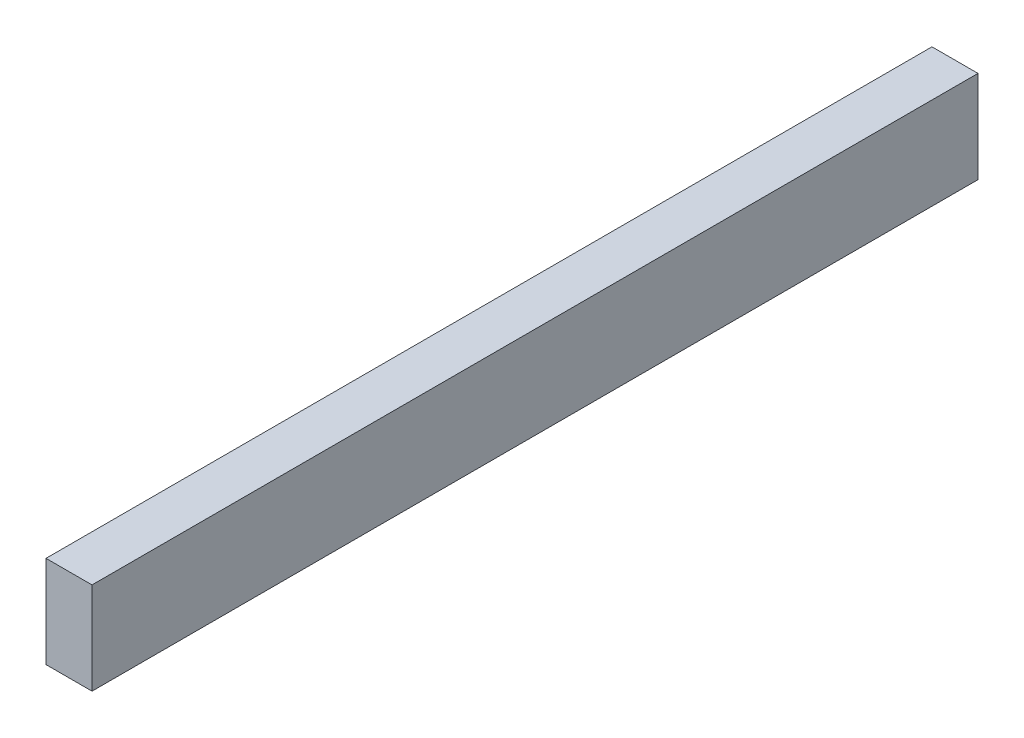
ISO-10303-21;
HEADER;
FILE_DESCRIPTION(('STEP AP214'),'2;1');
FILE_NAME('part.step','',(''),(''),'','','');
FILE_SCHEMA(('AUTOMOTIVE_DESIGN { 1 0 10303 214 1 1 1 1 }'));
ENDSEC;
DATA;
#1=APPLICATION_CONTEXT('core data for automotive mechanical design processes');
#2=APPLICATION_PROTOCOL_DEFINITION('international standard','automotive_design',2000,#1);
#3=PRODUCT_CONTEXT('',#1,'mechanical');
#4=PRODUCT('Part','Part','',(#3));
#5=PRODUCT_RELATED_PRODUCT_CATEGORY('part','',(#4));
#6=PRODUCT_DEFINITION_FORMATION('','',#4);
#7=PRODUCT_DEFINITION_CONTEXT('part definition',#1,'design');
#8=PRODUCT_DEFINITION('design','',#6,#7);
#9=PRODUCT_DEFINITION_SHAPE('','',#8);
#10=(LENGTH_UNIT() NAMED_UNIT(*) SI_UNIT(.MILLI.,.METRE.));
#11=(NAMED_UNIT(*) PLANE_ANGLE_UNIT() SI_UNIT($,.RADIAN.));
#12=(NAMED_UNIT(*) SI_UNIT($,.STERADIAN.) SOLID_ANGLE_UNIT());
#13=UNCERTAINTY_MEASURE_WITH_UNIT(LENGTH_MEASURE(1.E-05),#10,'distance_accuracy_value','');
#14=(GEOMETRIC_REPRESENTATION_CONTEXT(3) GLOBAL_UNCERTAINTY_ASSIGNED_CONTEXT((#13)) GLOBAL_UNIT_ASSIGNED_CONTEXT((#10,
#11,#12)) REPRESENTATION_CONTEXT('',''));
#15=CARTESIAN_POINT('',(0.,0.,0.));
#16=DIRECTION('',(0.,0.,1.));
#17=DIRECTION('',(1.,0.,0.));
#18=AXIS2_PLACEMENT_3D('',#15,#16,#17);
#19=CARTESIAN_POINT('',(0.,0.,366.7125));
#20=DIRECTION('',(1.,0.,0.));
#21=DIRECTION('',(0.,0.,-1.));
#22=AXIS2_PLACEMENT_3D('',#19,#20,#21);
#23=PLANE('',#22);
#24=DIRECTION('',(0.,-1.,0.));
#25=VECTOR('',#24,1.);
#26=CARTESIAN_POINT('',(0.,0.,0.));
#27=LINE('',#26,#25);
#28=CARTESIAN_POINT('',(0.,38.1,0.));
#29=VERTEX_POINT('',#28);
#30=CARTESIAN_POINT('',(0.,0.,0.));
#31=VERTEX_POINT('',#30);
#32=EDGE_CURVE('E96',#29,#31,#27,.T.);
#33=ORIENTED_EDGE('',*,*,#32,.T.);
#34=DIRECTION('',(0.,0.,-1.));
#35=VECTOR('',#34,1.);
#36=CARTESIAN_POINT('',(0.,0.,366.7125));
#37=LINE('',#36,#35);
#38=CARTESIAN_POINT('',(0.,0.,366.7125));
#39=VERTEX_POINT('',#38);
#40=EDGE_CURVE('E11',#39,#31,#37,.T.);
#41=ORIENTED_EDGE('',*,*,#40,.F.);
#42=DIRECTION('',(0.,-1.,0.));
#43=VECTOR('',#42,1.);
#44=CARTESIAN_POINT('',(0.,0.,366.7125));
#45=LINE('',#44,#43);
#46=CARTESIAN_POINT('',(0.,38.1,366.7125));
#47=VERTEX_POINT('',#46);
#48=EDGE_CURVE('E84',#47,#39,#45,.T.);
#49=ORIENTED_EDGE('',*,*,#48,.F.);
#50=DIRECTION('',(0.,0.,-1.));
#51=VECTOR('',#50,1.);
#52=CARTESIAN_POINT('',(0.,38.1,366.7125));
#53=LINE('',#52,#51);
#54=EDGE_CURVE('E92',#47,#29,#53,.T.);
#55=ORIENTED_EDGE('',*,*,#54,.T.);
#56=EDGE_LOOP('',(#33,#41,#49,#55));
#57=FACE_BOUND('',#56,.T.);
#58=ADVANCED_FACE('F33',(#57),#23,.F.);
#59=CARTESIAN_POINT('',(0.,0.,366.7125));
#60=DIRECTION('',(0.,1.,0.));
#61=DIRECTION('',(0.,0.,1.));
#62=AXIS2_PLACEMENT_3D('',#59,#60,#61);
#63=PLANE('',#62);
#64=DIRECTION('',(1.,0.,0.));
#65=VECTOR('',#64,1.);
#66=CARTESIAN_POINT('',(0.,0.,0.));
#67=LINE('',#66,#65);
#68=CARTESIAN_POINT('',(19.05,0.,0.));
#69=VERTEX_POINT('',#68);
#70=EDGE_CURVE('E88',#31,#69,#67,.T.);
#71=ORIENTED_EDGE('',*,*,#70,.T.);
#72=DIRECTION('',(0.,0.,-1.));
#73=VECTOR('',#72,1.);
#74=CARTESIAN_POINT('',(19.05,0.,366.7125));
#75=LINE('',#74,#73);
#76=CARTESIAN_POINT('',(19.05,0.,366.7125));
#77=VERTEX_POINT('',#76);
#78=EDGE_CURVE('E41',#77,#69,#75,.T.);
#79=ORIENTED_EDGE('',*,*,#78,.F.);
#80=DIRECTION('',(1.,0.,0.));
#81=VECTOR('',#80,1.);
#82=CARTESIAN_POINT('',(0.,0.,366.7125));
#83=LINE('',#82,#81);
#84=EDGE_CURVE('E79',#39,#77,#83,.T.);
#85=ORIENTED_EDGE('',*,*,#84,.F.);
#86=ORIENTED_EDGE('',*,*,#40,.T.);
#87=EDGE_LOOP('',(#71,#79,#85,#86));
#88=FACE_BOUND('',#87,.T.);
#89=ADVANCED_FACE('F87',(#88),#63,.F.);
#90=CARTESIAN_POINT('',(19.05,0.,366.7125));
#91=DIRECTION('',(-1.,0.,0.));
#92=DIRECTION('',(0.,0.,1.));
#93=AXIS2_PLACEMENT_3D('',#90,#91,#92);
#94=PLANE('',#93);
#95=DIRECTION('',(0.,1.,0.));
#96=VECTOR('',#95,1.);
#97=CARTESIAN_POINT('',(19.05,0.,0.));
#98=LINE('',#97,#96);
#99=CARTESIAN_POINT('',(19.05,38.1,0.));
#100=VERTEX_POINT('',#99);
#101=EDGE_CURVE('E66',#69,#100,#98,.T.);
#102=ORIENTED_EDGE('',*,*,#101,.T.);
#103=DIRECTION('',(0.,0.,-1.));
#104=VECTOR('',#103,1.);
#105=CARTESIAN_POINT('',(19.05,38.1,366.7125));
#106=LINE('',#105,#104);
#107=CARTESIAN_POINT('',(19.05,38.1,366.7125));
#108=VERTEX_POINT('',#107);
#109=EDGE_CURVE('E89',#108,#100,#106,.T.);
#110=ORIENTED_EDGE('',*,*,#109,.F.);
#111=DIRECTION('',(0.,1.,0.));
#112=VECTOR('',#111,1.);
#113=CARTESIAN_POINT('',(19.05,0.,366.7125));
#114=LINE('',#113,#112);
#115=EDGE_CURVE('E82',#77,#108,#114,.T.);
#116=ORIENTED_EDGE('',*,*,#115,.F.);
#117=ORIENTED_EDGE('',*,*,#78,.T.);
#118=EDGE_LOOP('',(#102,#110,#116,#117));
#119=FACE_BOUND('',#118,.T.);
#120=ADVANCED_FACE('F90',(#119),#94,.F.);
#121=CARTESIAN_POINT('',(0.,38.1,366.7125));
#122=DIRECTION('',(0.,-1.,0.));
#123=DIRECTION('',(0.,0.,-1.));
#124=AXIS2_PLACEMENT_3D('',#121,#122,#123);
#125=PLANE('',#124);
#126=DIRECTION('',(-1.,0.,0.));
#127=VECTOR('',#126,1.);
#128=CARTESIAN_POINT('',(0.,38.1,0.));
#129=LINE('',#128,#127);
#130=EDGE_CURVE('E72',#100,#29,#129,.T.);
#131=ORIENTED_EDGE('',*,*,#130,.T.);
#132=ORIENTED_EDGE('',*,*,#54,.F.);
#133=DIRECTION('',(-1.,0.,0.));
#134=VECTOR('',#133,1.);
#135=CARTESIAN_POINT('',(0.,38.1,366.7125));
#136=LINE('',#135,#134);
#137=EDGE_CURVE('E49',#108,#47,#136,.T.);
#138=ORIENTED_EDGE('',*,*,#137,.F.);
#139=ORIENTED_EDGE('',*,*,#109,.T.);
#140=EDGE_LOOP('',(#131,#132,#138,#139));
#141=FACE_BOUND('',#140,.T.);
#142=ADVANCED_FACE('F103',(#141),#125,.F.);
#143=CARTESIAN_POINT('',(0.,0.,366.7125));
#144=DIRECTION('',(0.,0.,-1.));
#145=DIRECTION('',(-1.,0.,0.));
#146=AXIS2_PLACEMENT_3D('',#143,#144,#145);
#147=PLANE('',#146);
#148=ORIENTED_EDGE('',*,*,#48,.T.);
#149=ORIENTED_EDGE('',*,*,#84,.T.);
#150=ORIENTED_EDGE('',*,*,#115,.T.);
#151=ORIENTED_EDGE('',*,*,#137,.T.);
#152=EDGE_LOOP('',(#148,#149,#150,#151));
#153=FACE_BOUND('',#152,.T.);
#154=ADVANCED_FACE('F80',(#153),#147,.F.);
#155=CARTESIAN_POINT('',(0.,0.,0.));
#156=DIRECTION('',(0.,0.,-1.));
#157=DIRECTION('',(-1.,0.,0.));
#158=AXIS2_PLACEMENT_3D('',#155,#156,#157);
#159=PLANE('',#158);
#160=ORIENTED_EDGE('',*,*,#32,.F.);
#161=ORIENTED_EDGE('',*,*,#130,.F.);
#162=ORIENTED_EDGE('',*,*,#101,.F.);
#163=ORIENTED_EDGE('',*,*,#70,.F.);
#164=EDGE_LOOP('',(#160,#161,#162,#163));
#165=FACE_BOUND('',#164,.T.);
#166=ADVANCED_FACE('F106',(#165),#159,.T.);
#167=CLOSED_SHELL('',(#58,#89,#120,#142,#154,#166));
#168=MANIFOLD_SOLID_BREP('B2',#167);
#169=ADVANCED_BREP_SHAPE_REPRESENTATION('',(#18,#168),#14);
#170=SHAPE_DEFINITION_REPRESENTATION(#9,#169);
ENDSEC;
END-ISO-10303-21;
